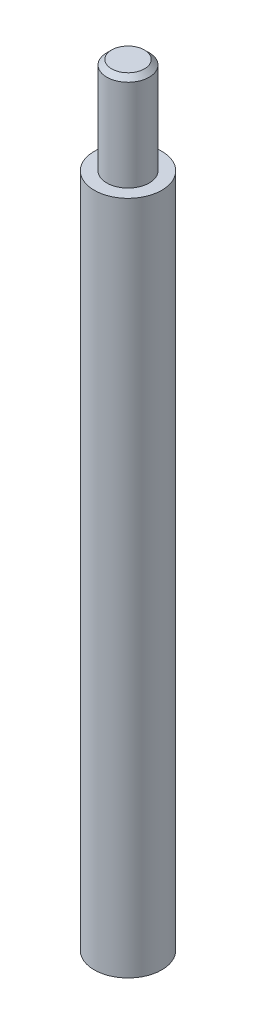
ISO-10303-21;
HEADER;
FILE_DESCRIPTION(('STEP AP214'),'2;1');
FILE_NAME('part.step','',(''),(''),'','','');
FILE_SCHEMA(('AUTOMOTIVE_DESIGN { 1 0 10303 214 1 1 1 1 }'));
ENDSEC;
DATA;
#1=APPLICATION_CONTEXT('core data for automotive mechanical design processes');
#2=APPLICATION_PROTOCOL_DEFINITION('international standard','automotive_design',2000,#1);
#3=PRODUCT_CONTEXT('',#1,'mechanical');
#4=PRODUCT('Part','Part','',(#3));
#5=PRODUCT_RELATED_PRODUCT_CATEGORY('part','',(#4));
#6=PRODUCT_DEFINITION_FORMATION('','',#4);
#7=PRODUCT_DEFINITION_CONTEXT('part definition',#1,'design');
#8=PRODUCT_DEFINITION('design','',#6,#7);
#9=PRODUCT_DEFINITION_SHAPE('','',#8);
#10=(LENGTH_UNIT() NAMED_UNIT(*) SI_UNIT(.MILLI.,.METRE.));
#11=(NAMED_UNIT(*) PLANE_ANGLE_UNIT() SI_UNIT($,.RADIAN.));
#12=(NAMED_UNIT(*) SI_UNIT($,.STERADIAN.) SOLID_ANGLE_UNIT());
#13=UNCERTAINTY_MEASURE_WITH_UNIT(LENGTH_MEASURE(1.E-05),#10,'distance_accuracy_value','');
#14=(GEOMETRIC_REPRESENTATION_CONTEXT(3) GLOBAL_UNCERTAINTY_ASSIGNED_CONTEXT((#13)) GLOBAL_UNIT_ASSIGNED_CONTEXT((#10,
#11,#12)) REPRESENTATION_CONTEXT('',''));
#15=CARTESIAN_POINT('',(0.,0.,0.));
#16=DIRECTION('',(0.,0.,1.));
#17=DIRECTION('',(1.,0.,0.));
#18=AXIS2_PLACEMENT_3D('',#15,#16,#17);
#19=CARTESIAN_POINT('',(0.,45.,0.));
#20=DIRECTION('',(0.,-1.,0.));
#21=DIRECTION('',(1.,0.,0.));
#22=AXIS2_PLACEMENT_3D('',#19,#20,#21);
#23=PLANE('',#22);
#24=CARTESIAN_POINT('',(-1.5436120494986E-13,45.,0.));
#25=DIRECTION('',(0.,-1.,0.));
#26=DIRECTION('',(1.,0.,0.));
#27=AXIS2_PLACEMENT_3D('',#24,#25,#26);
#28=CIRCLE('',#27,1.6999999999999);
#29=CARTESIAN_POINT('',(1.69999999999975,45.,0.));
#30=VERTEX_POINT('',#29);
#31=EDGE_CURVE('E10',#30,#30,#28,.F.);
#32=ORIENTED_EDGE('',*,*,#31,.T.);
#33=EDGE_LOOP('',(#32));
#34=FACE_BOUND('',#33,.T.);
#35=ADVANCED_FACE('F43',(#34),#23,.F.);
#36=CARTESIAN_POINT('',(1.70048475552006E-12,-495.732162904914,0.));
#37=DIRECTION('',(0.,-1.,0.));
#38=DIRECTION('',(1.,0.,0.));
#39=AXIS2_PLACEMENT_3D('',#36,#37,#38);
#40=CYLINDRICAL_SURFACE('',#39,2.19999999999987);
#41=CARTESIAN_POINT('',(-1.52646080450417E-13,44.5,0.));
#42=DIRECTION('',(0.,-1.,0.));
#43=DIRECTION('',(1.,0.,0.));
#44=AXIS2_PLACEMENT_3D('',#41,#42,#43);
#45=CIRCLE('',#44,2.19999999999987);
#46=CARTESIAN_POINT('',(2.19999999999972,44.5,0.));
#47=VERTEX_POINT('',#46);
#48=EDGE_CURVE('E51',#47,#47,#45,.T.);
#49=ORIENTED_EDGE('',*,*,#48,.T.);
#50=EDGE_LOOP('',(#49));
#51=FACE_BOUND('',#50,.T.);
#52=CARTESIAN_POINT('',(-1.20058714961002E-13,35.,0.));
#53=DIRECTION('',(0.,-1.,0.));
#54=DIRECTION('',(1.,0.,0.));
#55=AXIS2_PLACEMENT_3D('',#52,#53,#54);
#56=CIRCLE('',#55,2.19999999999989);
#57=CARTESIAN_POINT('',(2.19999999999977,35.,0.));
#58=VERTEX_POINT('',#57);
#59=EDGE_CURVE('E55',#58,#58,#56,.T.);
#60=ORIENTED_EDGE('',*,*,#59,.F.);
#61=EDGE_LOOP('',(#60));
#62=FACE_BOUND('',#61,.T.);
#63=ADVANCED_FACE('F79',(#51,#62),#40,.T.);
#64=CARTESIAN_POINT('',(-2.20000000000001,35.,0.));
#65=DIRECTION('',(0.,-1.,0.));
#66=DIRECTION('',(1.,0.,0.));
#67=AXIS2_PLACEMENT_3D('',#64,#65,#66);
#68=PLANE('',#67);
#69=CARTESIAN_POINT('',(-1.20058714961002E-13,35.,0.));
#70=DIRECTION('',(0.,-1.,0.));
#71=DIRECTION('',(1.,0.,0.));
#72=AXIS2_PLACEMENT_3D('',#69,#70,#71);
#73=CIRCLE('',#72,3.49999999999987);
#74=CARTESIAN_POINT('',(3.49999999999975,35.,0.));
#75=VERTEX_POINT('',#74);
#76=EDGE_CURVE('E59',#75,#75,#73,.T.);
#77=ORIENTED_EDGE('',*,*,#76,.F.);
#78=EDGE_LOOP('',(#77));
#79=FACE_BOUND('',#78,.T.);
#80=ORIENTED_EDGE('',*,*,#59,.T.);
#81=EDGE_LOOP('',(#80));
#82=FACE_BOUND('',#81,.T.);
#83=ADVANCED_FACE('F73',(#79,#82),#68,.F.);
#84=CARTESIAN_POINT('',(1.70048475552006E-12,-495.732162904914,0.));
#85=DIRECTION('',(0.,-1.,0.));
#86=DIRECTION('',(1.,0.,0.));
#87=AXIS2_PLACEMENT_3D('',#84,#85,#86);
#88=CYLINDRICAL_SURFACE('',#87,3.49999999999999);
#89=CARTESIAN_POINT('',(1.20058714961002E-13,-35.,0.));
#90=DIRECTION('',(0.,-1.,0.));
#91=DIRECTION('',(1.,0.,0.));
#92=AXIS2_PLACEMENT_3D('',#89,#90,#91);
#93=CIRCLE('',#92,3.50000000000011);
#94=CARTESIAN_POINT('',(3.50000000000023,-35.,0.));
#95=VERTEX_POINT('',#94);
#96=EDGE_CURVE('E64',#95,#95,#93,.T.);
#97=ORIENTED_EDGE('',*,*,#96,.F.);
#98=EDGE_LOOP('',(#97));
#99=FACE_BOUND('',#98,.T.);
#100=ORIENTED_EDGE('',*,*,#76,.T.);
#101=EDGE_LOOP('',(#100));
#102=FACE_BOUND('',#101,.T.);
#103=ADVANCED_FACE('F70',(#99,#102),#88,.T.);
#104=CARTESIAN_POINT('',(-3.49999999999999,-35.,0.));
#105=DIRECTION('',(0.,1.,0.));
#106=DIRECTION('',(-1.,0.,0.));
#107=AXIS2_PLACEMENT_3D('',#104,#105,#106);
#108=PLANE('',#107);
#109=ORIENTED_EDGE('',*,*,#96,.T.);
#110=EDGE_LOOP('',(#109));
#111=FACE_BOUND('',#110,.T.);
#112=ADVANCED_FACE('F68',(#111),#108,.F.);
#113=CARTESIAN_POINT('',(-1.52646080450417E-13,44.5,0.));
#114=DIRECTION('',(0.,-1.,0.));
#115=DIRECTION('',(1.,0.,0.));
#116=AXIS2_PLACEMENT_3D('',#113,#114,#115);
#117=CONICAL_SURFACE('',#116,2.19999999999987,0.785398163397386);
#118=ORIENTED_EDGE('',*,*,#31,.F.);
#119=EDGE_LOOP('',(#118));
#120=FACE_BOUND('',#119,.T.);
#121=ORIENTED_EDGE('',*,*,#48,.F.);
#122=EDGE_LOOP('',(#121));
#123=FACE_BOUND('',#122,.T.);
#124=ADVANCED_FACE('F46',(#120,#123),#117,.T.);
#125=CLOSED_SHELL('',(#35,#63,#83,#103,#112,#124));
#126=MANIFOLD_SOLID_BREP('B2',#125);
#127=ADVANCED_BREP_SHAPE_REPRESENTATION('',(#18,#126),#14);
#128=SHAPE_DEFINITION_REPRESENTATION(#9,#127);
ENDSEC;
END-ISO-10303-21;
